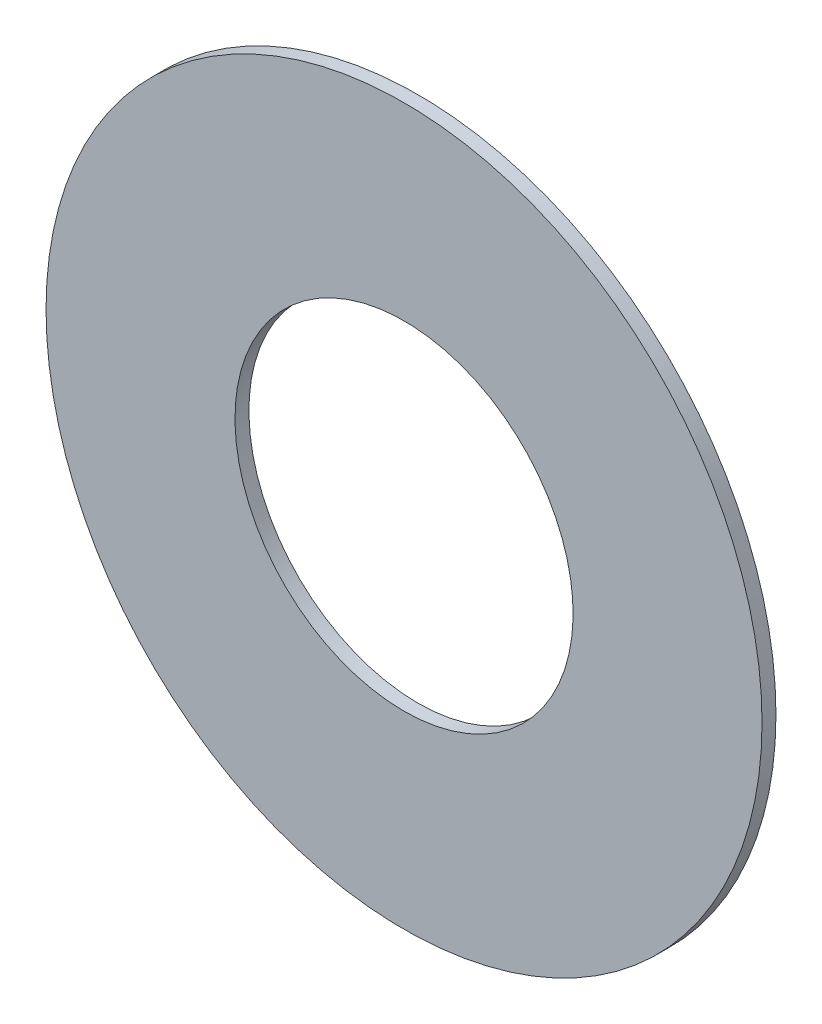
ISO-10303-21;
HEADER;
FILE_DESCRIPTION(('STEP AP214'),'2;1');
FILE_NAME('part.step','',(''),(''),'','','');
FILE_SCHEMA(('AUTOMOTIVE_DESIGN { 1 0 10303 214 1 1 1 1 }'));
ENDSEC;
DATA;
#1=APPLICATION_CONTEXT('core data for automotive mechanical design processes');
#2=APPLICATION_PROTOCOL_DEFINITION('international standard','automotive_design',2000,#1);
#3=PRODUCT_CONTEXT('',#1,'mechanical');
#4=PRODUCT('Part','Part','',(#3));
#5=PRODUCT_RELATED_PRODUCT_CATEGORY('part','',(#4));
#6=PRODUCT_DEFINITION_FORMATION('','',#4);
#7=PRODUCT_DEFINITION_CONTEXT('part definition',#1,'design');
#8=PRODUCT_DEFINITION('design','',#6,#7);
#9=PRODUCT_DEFINITION_SHAPE('','',#8);
#10=(LENGTH_UNIT() NAMED_UNIT(*) SI_UNIT(.MILLI.,.METRE.));
#11=(NAMED_UNIT(*) PLANE_ANGLE_UNIT() SI_UNIT($,.RADIAN.));
#12=(NAMED_UNIT(*) SI_UNIT($,.STERADIAN.) SOLID_ANGLE_UNIT());
#13=UNCERTAINTY_MEASURE_WITH_UNIT(LENGTH_MEASURE(1.E-05),#10,'distance_accuracy_value','');
#14=(GEOMETRIC_REPRESENTATION_CONTEXT(3) GLOBAL_UNCERTAINTY_ASSIGNED_CONTEXT((#13)) GLOBAL_UNIT_ASSIGNED_CONTEXT((#10,
#11,#12)) REPRESENTATION_CONTEXT('',''));
#15=CARTESIAN_POINT('',(0.,0.,0.));
#16=DIRECTION('',(0.,0.,1.));
#17=DIRECTION('',(1.,0.,0.));
#18=AXIS2_PLACEMENT_3D('',#15,#16,#17);
#19=CARTESIAN_POINT('',(171.958,-153.249,-0.045));
#20=DIRECTION('',(0.,0.,-1.));
#21=DIRECTION('',(0.,-1.,0.));
#22=AXIS2_PLACEMENT_3D('',#19,#20,#21);
#23=CYLINDRICAL_SURFACE('',#22,0.425);
#24=CARTESIAN_POINT('',(171.958,-153.249,1.67));
#25=DIRECTION('',(0.,0.,-1.));
#26=DIRECTION('',(0.,-1.,0.));
#27=AXIS2_PLACEMENT_3D('',#24,#25,#26);
#28=CIRCLE('',#27,0.425);
#29=CARTESIAN_POINT('',(171.958,-153.674,1.67));
#30=VERTEX_POINT('',#29);
#31=EDGE_CURVE('E25',#30,#30,#28,.T.);
#32=ORIENTED_EDGE('',*,*,#31,.T.);
#33=DIRECTION('',(0.,0.,1.));
#34=VECTOR('',#33,1.);
#35=CARTESIAN_POINT('',(171.958,-153.674,-0.045));
#36=LINE('',#35,#34);
#37=CARTESIAN_POINT('',(171.958,-153.674,1.705));
#38=VERTEX_POINT('',#37);
#39=EDGE_CURVE('E11',#30,#38,#36,.T.);
#40=ORIENTED_EDGE('',*,*,#39,.T.);
#41=CARTESIAN_POINT('',(171.958,-153.249,1.705));
#42=DIRECTION('',(0.,0.,-1.));
#43=DIRECTION('',(0.,-1.,0.));
#44=AXIS2_PLACEMENT_3D('',#41,#42,#43);
#45=CIRCLE('',#44,0.425);
#46=EDGE_CURVE('E69',#38,#38,#45,.T.);
#47=ORIENTED_EDGE('',*,*,#46,.F.);
#48=ORIENTED_EDGE('',*,*,#39,.F.);
#49=EDGE_LOOP('',(#32,#40,#47,#48));
#50=FACE_BOUND('',#49,.T.);
#51=ADVANCED_FACE('F17',(#50),#23,.F.);
#52=CARTESIAN_POINT('',(171.958,-153.249,1.67));
#53=DIRECTION('',(0.,0.,1.));
#54=DIRECTION('',(1.,0.,0.));
#55=AXIS2_PLACEMENT_3D('',#52,#53,#54);
#56=PLANE('',#55);
#57=ORIENTED_EDGE('',*,*,#31,.F.);
#58=EDGE_LOOP('',(#57));
#59=FACE_BOUND('',#58,.T.);
#60=CARTESIAN_POINT('',(171.958,-153.249,1.67));
#61=DIRECTION('',(0.,0.,1.));
#62=DIRECTION('',(1.,0.,0.));
#63=AXIS2_PLACEMENT_3D('',#60,#61,#62);
#64=CIRCLE('',#63,0.9);
#65=CARTESIAN_POINT('',(172.858,-153.249,1.67));
#66=VERTEX_POINT('',#65);
#67=EDGE_CURVE('E56',#66,#66,#64,.T.);
#68=ORIENTED_EDGE('',*,*,#67,.F.);
#69=EDGE_LOOP('',(#68));
#70=FACE_BOUND('',#69,.T.);
#71=ADVANCED_FACE('F76',(#59,#70),#56,.F.);
#72=CARTESIAN_POINT('',(171.958,-153.249,1.705));
#73=DIRECTION('',(0.,0.,1.));
#74=DIRECTION('',(1.,0.,0.));
#75=AXIS2_PLACEMENT_3D('',#72,#73,#74);
#76=PLANE('',#75);
#77=ORIENTED_EDGE('',*,*,#46,.T.);
#78=EDGE_LOOP('',(#77));
#79=FACE_BOUND('',#78,.T.);
#80=CARTESIAN_POINT('',(171.958,-153.249,1.705));
#81=DIRECTION('',(0.,0.,1.));
#82=DIRECTION('',(1.,0.,0.));
#83=AXIS2_PLACEMENT_3D('',#80,#81,#82);
#84=CIRCLE('',#83,0.9);
#85=CARTESIAN_POINT('',(172.858,-153.249,1.705));
#86=VERTEX_POINT('',#85);
#87=EDGE_CURVE('E54',#86,#86,#84,.T.);
#88=ORIENTED_EDGE('',*,*,#87,.T.);
#89=EDGE_LOOP('',(#88));
#90=FACE_BOUND('',#89,.T.);
#91=ADVANCED_FACE('F60',(#79,#90),#76,.T.);
#92=CARTESIAN_POINT('',(171.958,-153.249,1.67));
#93=DIRECTION('',(0.,0.,1.));
#94=DIRECTION('',(1.,0.,0.));
#95=AXIS2_PLACEMENT_3D('',#92,#93,#94);
#96=CYLINDRICAL_SURFACE('',#95,0.9);
#97=ORIENTED_EDGE('',*,*,#87,.F.);
#98=DIRECTION('',(0.,0.,1.));
#99=VECTOR('',#98,1.);
#100=CARTESIAN_POINT('',(172.858,-153.249,1.67));
#101=LINE('',#100,#99);
#102=EDGE_CURVE('E51',#66,#86,#101,.T.);
#103=ORIENTED_EDGE('',*,*,#102,.F.);
#104=ORIENTED_EDGE('',*,*,#67,.T.);
#105=ORIENTED_EDGE('',*,*,#102,.T.);
#106=EDGE_LOOP('',(#97,#103,#104,#105));
#107=FACE_BOUND('',#106,.T.);
#108=ADVANCED_FACE('F53',(#107),#96,.T.);
#109=CLOSED_SHELL('',(#51,#71,#91,#108));
#110=MANIFOLD_SOLID_BREP('B1',#109);
#111=ADVANCED_BREP_SHAPE_REPRESENTATION('',(#18,#110),#14);
#112=SHAPE_DEFINITION_REPRESENTATION(#9,#111);
ENDSEC;
END-ISO-10303-21;
